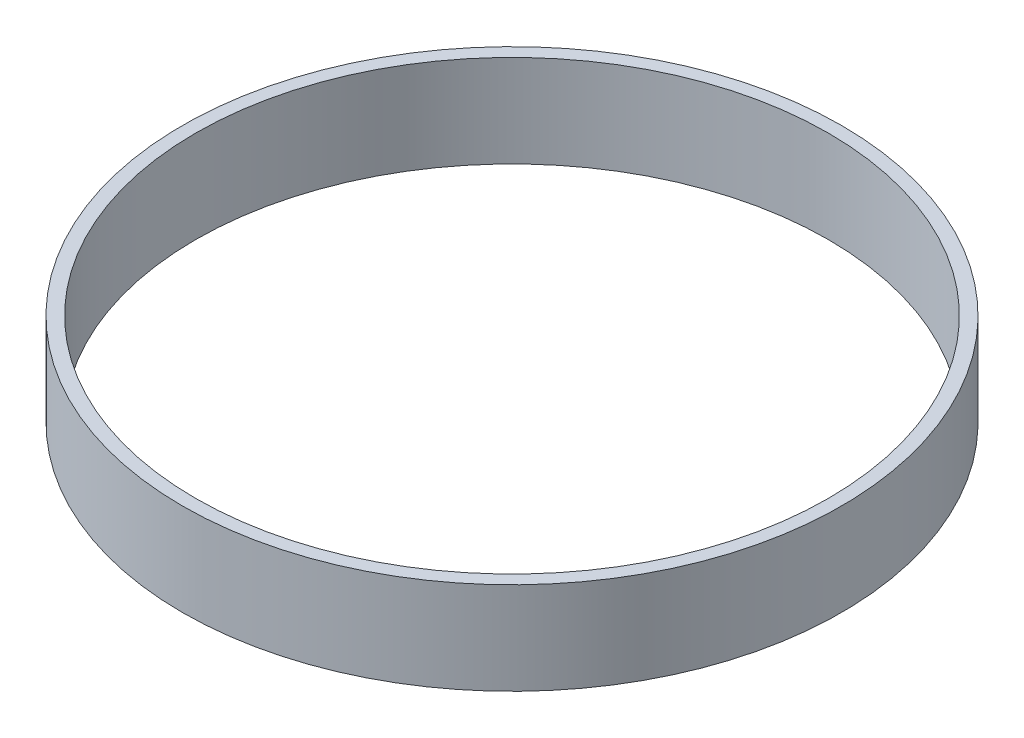
ISO-10303-21;
HEADER;
FILE_DESCRIPTION(('STEP AP214'),'2;1');
FILE_NAME('part.step','',(''),(''),'','','');
FILE_SCHEMA(('AUTOMOTIVE_DESIGN { 1 0 10303 214 1 1 1 1 }'));
ENDSEC;
DATA;
#1=APPLICATION_CONTEXT('core data for automotive mechanical design processes');
#2=APPLICATION_PROTOCOL_DEFINITION('international standard','automotive_design',2000,#1);
#3=PRODUCT_CONTEXT('',#1,'mechanical');
#4=PRODUCT('Part','Part','',(#3));
#5=PRODUCT_RELATED_PRODUCT_CATEGORY('part','',(#4));
#6=PRODUCT_DEFINITION_FORMATION('','',#4);
#7=PRODUCT_DEFINITION_CONTEXT('part definition',#1,'design');
#8=PRODUCT_DEFINITION('design','',#6,#7);
#9=PRODUCT_DEFINITION_SHAPE('','',#8);
#10=(LENGTH_UNIT() NAMED_UNIT(*) SI_UNIT(.MILLI.,.METRE.));
#11=(NAMED_UNIT(*) PLANE_ANGLE_UNIT() SI_UNIT($,.RADIAN.));
#12=(NAMED_UNIT(*) SI_UNIT($,.STERADIAN.) SOLID_ANGLE_UNIT());
#13=UNCERTAINTY_MEASURE_WITH_UNIT(LENGTH_MEASURE(1.E-05),#10,'distance_accuracy_value','');
#14=(GEOMETRIC_REPRESENTATION_CONTEXT(3) GLOBAL_UNCERTAINTY_ASSIGNED_CONTEXT((#13)) GLOBAL_UNIT_ASSIGNED_CONTEXT((#10,
#11,#12)) REPRESENTATION_CONTEXT('',''));
#15=CARTESIAN_POINT('',(0.,0.,0.));
#16=DIRECTION('',(0.,0.,1.));
#17=DIRECTION('',(1.,0.,0.));
#18=AXIS2_PLACEMENT_3D('',#15,#16,#17);
#19=CARTESIAN_POINT('',(0.,21.,0.));
#20=DIRECTION('',(0.,1.,0.));
#21=DIRECTION('',(0.,0.,1.));
#22=AXIS2_PLACEMENT_3D('',#19,#20,#21);
#23=PLANE('',#22);
#24=CARTESIAN_POINT('',(0.,21.,0.));
#25=DIRECTION('',(0.,1.,0.));
#26=DIRECTION('',(0.,0.,1.));
#27=AXIS2_PLACEMENT_3D('',#24,#25,#26);
#28=CIRCLE('',#27,75.);
#29=CARTESIAN_POINT('',(0.,21.,75.));
#30=VERTEX_POINT('',#29);
#31=EDGE_CURVE('E10',#30,#30,#28,.T.);
#32=ORIENTED_EDGE('',*,*,#31,.T.);
#33=EDGE_LOOP('',(#32));
#34=FACE_BOUND('',#33,.T.);
#35=CARTESIAN_POINT('',(0.,21.,0.));
#36=DIRECTION('',(0.,1.,0.));
#37=DIRECTION('',(0.,0.,1.));
#38=AXIS2_PLACEMENT_3D('',#35,#36,#37);
#39=CIRCLE('',#38,72.);
#40=CARTESIAN_POINT('',(0.,21.,72.));
#41=VERTEX_POINT('',#40);
#42=EDGE_CURVE('E43',#41,#41,#39,.T.);
#43=ORIENTED_EDGE('',*,*,#42,.F.);
#44=EDGE_LOOP('',(#43));
#45=FACE_BOUND('',#44,.T.);
#46=ADVANCED_FACE('F32',(#34,#45),#23,.T.);
#47=CARTESIAN_POINT('',(0.,0.,0.));
#48=DIRECTION('',(0.,1.,0.));
#49=DIRECTION('',(0.,0.,1.));
#50=AXIS2_PLACEMENT_3D('',#47,#48,#49);
#51=PLANE('',#50);
#52=CARTESIAN_POINT('',(0.,0.,0.));
#53=DIRECTION('',(0.,1.,0.));
#54=DIRECTION('',(0.,0.,1.));
#55=AXIS2_PLACEMENT_3D('',#52,#53,#54);
#56=CIRCLE('',#55,75.);
#57=CARTESIAN_POINT('',(0.,0.,75.));
#58=VERTEX_POINT('',#57);
#59=EDGE_CURVE('E36',#58,#58,#56,.T.);
#60=ORIENTED_EDGE('',*,*,#59,.F.);
#61=EDGE_LOOP('',(#60));
#62=FACE_BOUND('',#61,.T.);
#63=CARTESIAN_POINT('',(0.,0.,0.));
#64=DIRECTION('',(0.,1.,0.));
#65=DIRECTION('',(0.,0.,1.));
#66=AXIS2_PLACEMENT_3D('',#63,#64,#65);
#67=CIRCLE('',#66,72.);
#68=CARTESIAN_POINT('',(0.,0.,72.));
#69=VERTEX_POINT('',#68);
#70=EDGE_CURVE('E45',#69,#69,#67,.T.);
#71=ORIENTED_EDGE('',*,*,#70,.T.);
#72=EDGE_LOOP('',(#71));
#73=FACE_BOUND('',#72,.T.);
#74=ADVANCED_FACE('F55',(#62,#73),#51,.F.);
#75=CARTESIAN_POINT('',(0.,21.,0.));
#76=DIRECTION('',(0.,-1.,0.));
#77=DIRECTION('',(0.,0.,-1.));
#78=AXIS2_PLACEMENT_3D('',#75,#76,#77);
#79=CYLINDRICAL_SURFACE('',#78,75.);
#80=ORIENTED_EDGE('',*,*,#31,.F.);
#81=EDGE_LOOP('',(#80));
#82=FACE_BOUND('',#81,.T.);
#83=ORIENTED_EDGE('',*,*,#59,.T.);
#84=EDGE_LOOP('',(#83));
#85=FACE_BOUND('',#84,.T.);
#86=ADVANCED_FACE('F34',(#82,#85),#79,.T.);
#87=CARTESIAN_POINT('',(0.,21.,0.));
#88=DIRECTION('',(0.,-1.,0.));
#89=DIRECTION('',(0.,0.,-1.));
#90=AXIS2_PLACEMENT_3D('',#87,#88,#89);
#91=CYLINDRICAL_SURFACE('',#90,72.);
#92=ORIENTED_EDGE('',*,*,#42,.T.);
#93=EDGE_LOOP('',(#92));
#94=FACE_BOUND('',#93,.T.);
#95=ORIENTED_EDGE('',*,*,#70,.F.);
#96=EDGE_LOOP('',(#95));
#97=FACE_BOUND('',#96,.T.);
#98=ADVANCED_FACE('F51',(#94,#97),#91,.F.);
#99=CLOSED_SHELL('',(#46,#74,#86,#98));
#100=MANIFOLD_SOLID_BREP('B2',#99);
#101=ADVANCED_BREP_SHAPE_REPRESENTATION('',(#18,#100),#14);
#102=SHAPE_DEFINITION_REPRESENTATION(#9,#101);
ENDSEC;
END-ISO-10303-21;
